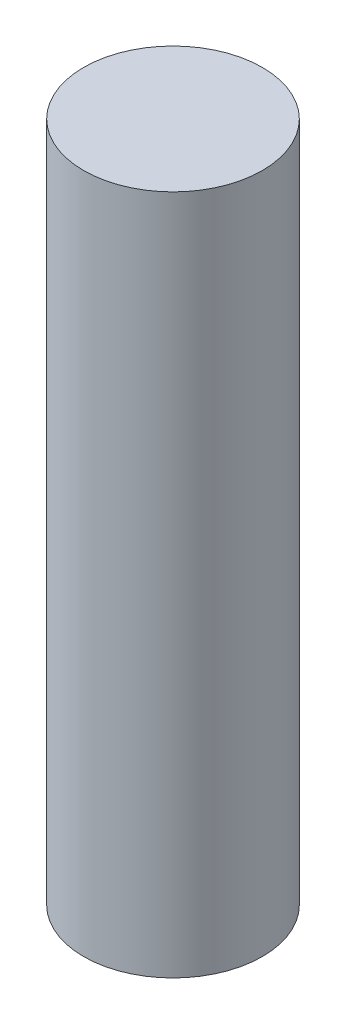
ISO-10303-21;
HEADER;
FILE_DESCRIPTION(('STEP AP214'),'2;1');
FILE_NAME('part.step','',(''),(''),'','','');
FILE_SCHEMA(('AUTOMOTIVE_DESIGN { 1 0 10303 214 1 1 1 1 }'));
ENDSEC;
DATA;
#1=APPLICATION_CONTEXT('core data for automotive mechanical design processes');
#2=APPLICATION_PROTOCOL_DEFINITION('international standard','automotive_design',2000,#1);
#3=PRODUCT_CONTEXT('',#1,'mechanical');
#4=PRODUCT('Part','Part','',(#3));
#5=PRODUCT_RELATED_PRODUCT_CATEGORY('part','',(#4));
#6=PRODUCT_DEFINITION_FORMATION('','',#4);
#7=PRODUCT_DEFINITION_CONTEXT('part definition',#1,'design');
#8=PRODUCT_DEFINITION('design','',#6,#7);
#9=PRODUCT_DEFINITION_SHAPE('','',#8);
#10=(LENGTH_UNIT() NAMED_UNIT(*) SI_UNIT(.MILLI.,.METRE.));
#11=(NAMED_UNIT(*) PLANE_ANGLE_UNIT() SI_UNIT($,.RADIAN.));
#12=(NAMED_UNIT(*) SI_UNIT($,.STERADIAN.) SOLID_ANGLE_UNIT());
#13=UNCERTAINTY_MEASURE_WITH_UNIT(LENGTH_MEASURE(1.E-05),#10,'distance_accuracy_value','');
#14=(GEOMETRIC_REPRESENTATION_CONTEXT(3) GLOBAL_UNCERTAINTY_ASSIGNED_CONTEXT((#13)) GLOBAL_UNIT_ASSIGNED_CONTEXT((#10,
#11,#12)) REPRESENTATION_CONTEXT('',''));
#15=CARTESIAN_POINT('',(0.,0.,0.));
#16=DIRECTION('',(0.,0.,1.));
#17=DIRECTION('',(1.,0.,0.));
#18=AXIS2_PLACEMENT_3D('',#15,#16,#17);
#19=CARTESIAN_POINT('',(0.,8.,0.));
#20=DIRECTION('',(0.,-1.,0.));
#21=DIRECTION('',(0.,0.,-1.));
#22=AXIS2_PLACEMENT_3D('',#19,#20,#21);
#23=CYLINDRICAL_SURFACE('',#22,1.05);
#24=CARTESIAN_POINT('',(0.,8.,0.));
#25=DIRECTION('',(0.,1.,0.));
#26=DIRECTION('',(0.,0.,1.));
#27=AXIS2_PLACEMENT_3D('',#24,#25,#26);
#28=CIRCLE('',#27,1.05);
#29=CARTESIAN_POINT('',(0.,8.,1.05));
#30=VERTEX_POINT('',#29);
#31=EDGE_CURVE('E10',#30,#30,#28,.T.);
#32=ORIENTED_EDGE('',*,*,#31,.F.);
#33=EDGE_LOOP('',(#32));
#34=FACE_BOUND('',#33,.T.);
#35=CARTESIAN_POINT('',(0.,0.,0.));
#36=DIRECTION('',(0.,1.,0.));
#37=DIRECTION('',(0.,0.,1.));
#38=AXIS2_PLACEMENT_3D('',#35,#36,#37);
#39=CIRCLE('',#38,1.05);
#40=CARTESIAN_POINT('',(0.,0.,1.05));
#41=VERTEX_POINT('',#40);
#42=EDGE_CURVE('E40',#41,#41,#39,.T.);
#43=ORIENTED_EDGE('',*,*,#42,.T.);
#44=EDGE_LOOP('',(#43));
#45=FACE_BOUND('',#44,.T.);
#46=ADVANCED_FACE('F37',(#34,#45),#23,.T.);
#47=CARTESIAN_POINT('',(0.,8.,0.));
#48=DIRECTION('',(0.,1.,0.));
#49=DIRECTION('',(0.,0.,1.));
#50=AXIS2_PLACEMENT_3D('',#47,#48,#49);
#51=PLANE('',#50);
#52=ORIENTED_EDGE('',*,*,#31,.T.);
#53=EDGE_LOOP('',(#52));
#54=FACE_BOUND('',#53,.T.);
#55=ADVANCED_FACE('F52',(#54),#51,.T.);
#56=CARTESIAN_POINT('',(0.,0.,0.));
#57=DIRECTION('',(0.,1.,0.));
#58=DIRECTION('',(0.,0.,1.));
#59=AXIS2_PLACEMENT_3D('',#56,#57,#58);
#60=PLANE('',#59);
#61=ORIENTED_EDGE('',*,*,#42,.F.);
#62=EDGE_LOOP('',(#61));
#63=FACE_BOUND('',#62,.T.);
#64=ADVANCED_FACE('F50',(#63),#60,.F.);
#65=CLOSED_SHELL('',(#46,#55,#64));
#66=MANIFOLD_SOLID_BREP('B2',#65);
#67=ADVANCED_BREP_SHAPE_REPRESENTATION('',(#18,#66),#14);
#68=SHAPE_DEFINITION_REPRESENTATION(#9,#67);
ENDSEC;
END-ISO-10303-21;
